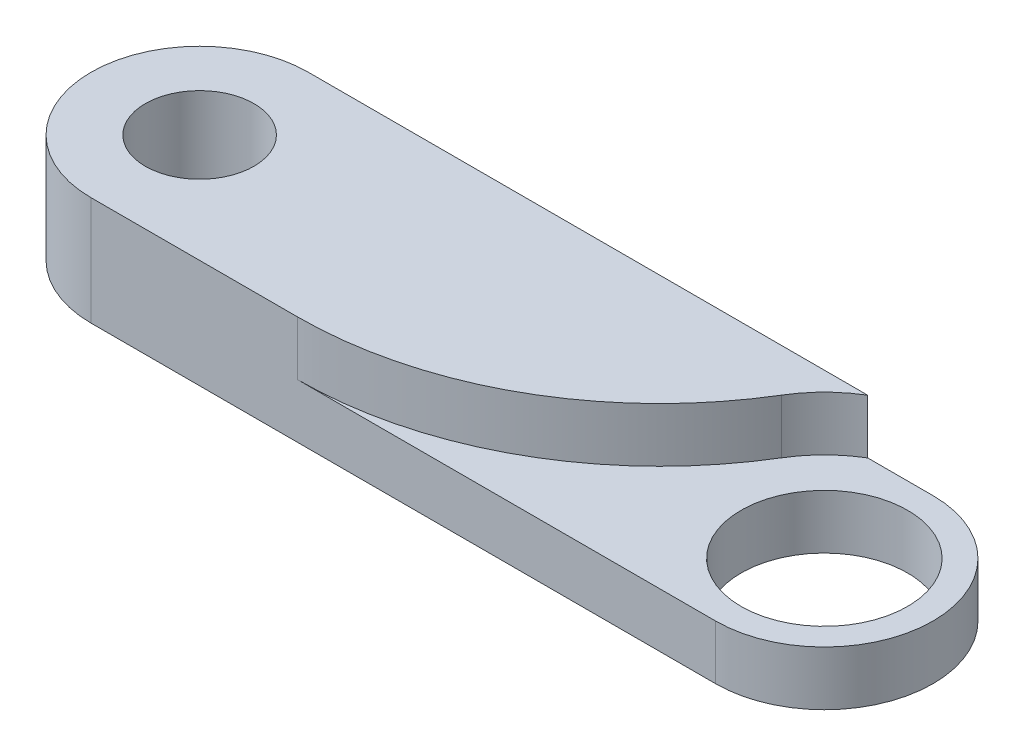
ISO-10303-21;
HEADER;
FILE_DESCRIPTION(('STEP AP214'),'2;1');
FILE_NAME('part.step','',(''),(''),'','','');
FILE_SCHEMA(('AUTOMOTIVE_DESIGN { 1 0 10303 214 1 1 1 1 }'));
ENDSEC;
DATA;
#1=APPLICATION_CONTEXT('core data for automotive mechanical design processes');
#2=APPLICATION_PROTOCOL_DEFINITION('international standard','automotive_design',2000,#1);
#3=PRODUCT_CONTEXT('',#1,'mechanical');
#4=PRODUCT('Part','Part','',(#3));
#5=PRODUCT_RELATED_PRODUCT_CATEGORY('part','',(#4));
#6=PRODUCT_DEFINITION_FORMATION('','',#4);
#7=PRODUCT_DEFINITION_CONTEXT('part definition',#1,'design');
#8=PRODUCT_DEFINITION('design','',#6,#7);
#9=PRODUCT_DEFINITION_SHAPE('','',#8);
#10=(LENGTH_UNIT() NAMED_UNIT(*) SI_UNIT(.MILLI.,.METRE.));
#11=(NAMED_UNIT(*) PLANE_ANGLE_UNIT() SI_UNIT($,.RADIAN.));
#12=(NAMED_UNIT(*) SI_UNIT($,.STERADIAN.) SOLID_ANGLE_UNIT());
#13=UNCERTAINTY_MEASURE_WITH_UNIT(LENGTH_MEASURE(1.E-05),#10,'distance_accuracy_value','');
#14=(GEOMETRIC_REPRESENTATION_CONTEXT(3) GLOBAL_UNCERTAINTY_ASSIGNED_CONTEXT((#13)) GLOBAL_UNIT_ASSIGNED_CONTEXT((#10,
#11,#12)) REPRESENTATION_CONTEXT('',''));
#15=CARTESIAN_POINT('',(0.,0.,0.));
#16=DIRECTION('',(0.,0.,1.));
#17=DIRECTION('',(1.,0.,0.));
#18=AXIS2_PLACEMENT_3D('',#15,#16,#17);
#19=CARTESIAN_POINT('',(17.25,6.,0.));
#20=DIRECTION('',(0.,-1.,0.));
#21=DIRECTION('',(0.,0.,-1.));
#22=AXIS2_PLACEMENT_3D('',#19,#20,#21);
#23=CYLINDRICAL_SURFACE('',#22,6.00000000000001);
#24=CARTESIAN_POINT('',(17.25,3.,0.));
#25=DIRECTION('',(0.,1.,0.));
#26=DIRECTION('',(0.,0.,1.));
#27=AXIS2_PLACEMENT_3D('',#24,#25,#26);
#28=CIRCLE('',#27,6.00000000000001);
#29=CARTESIAN_POINT('',(17.25,3.,6.));
#30=VERTEX_POINT('',#29);
#31=CARTESIAN_POINT('',(17.25,3.,-6.00000000000001));
#32=VERTEX_POINT('',#31);
#33=EDGE_CURVE('E162',#30,#32,#28,.T.);
#34=ORIENTED_EDGE('',*,*,#33,.F.);
#35=DIRECTION('',(0.,-1.,0.));
#36=VECTOR('',#35,1.);
#37=CARTESIAN_POINT('',(17.25,6.,6.));
#38=LINE('',#37,#36);
#39=CARTESIAN_POINT('',(17.25,0.,6.));
#40=VERTEX_POINT('',#39);
#41=EDGE_CURVE('E133',#30,#40,#38,.T.);
#42=ORIENTED_EDGE('',*,*,#41,.T.);
#43=CARTESIAN_POINT('',(17.25,0.,0.));
#44=DIRECTION('',(0.,1.,0.));
#45=DIRECTION('',(0.,0.,1.));
#46=AXIS2_PLACEMENT_3D('',#43,#44,#45);
#47=CIRCLE('',#46,6.00000000000001);
#48=CARTESIAN_POINT('',(17.25,0.,-6.00000000000001));
#49=VERTEX_POINT('',#48);
#50=EDGE_CURVE('E127',#40,#49,#47,.T.);
#51=ORIENTED_EDGE('',*,*,#50,.T.);
#52=DIRECTION('',(0.,-1.,0.));
#53=VECTOR('',#52,1.);
#54=CARTESIAN_POINT('',(17.25,6.,-6.00000000000001));
#55=LINE('',#54,#53);
#56=EDGE_CURVE('E114',#32,#49,#55,.T.);
#57=ORIENTED_EDGE('',*,*,#56,.F.);
#58=EDGE_LOOP('',(#34,#42,#51,#57));
#59=FACE_BOUND('',#58,.T.);
#60=ADVANCED_FACE('F34',(#59),#23,.T.);
#61=CARTESIAN_POINT('',(17.25,6.,0.));
#62=DIRECTION('',(0.,-1.,0.));
#63=DIRECTION('',(0.,0.,-1.));
#64=AXIS2_PLACEMENT_3D('',#61,#62,#63);
#65=CYLINDRICAL_SURFACE('',#64,4.6);
#66=CARTESIAN_POINT('',(17.25,0.,0.));
#67=DIRECTION('',(0.,1.,0.));
#68=DIRECTION('',(0.,0.,1.));
#69=AXIS2_PLACEMENT_3D('',#66,#67,#68);
#70=CIRCLE('',#69,4.6);
#71=CARTESIAN_POINT('',(17.25,0.,4.59999999999999));
#72=VERTEX_POINT('',#71);
#73=EDGE_CURVE('E165',#72,#72,#70,.T.);
#74=ORIENTED_EDGE('',*,*,#73,.F.);
#75=EDGE_LOOP('',(#74));
#76=FACE_BOUND('',#75,.T.);
#77=CARTESIAN_POINT('',(17.25,3.,0.));
#78=DIRECTION('',(0.,1.,0.));
#79=DIRECTION('',(0.,0.,1.));
#80=AXIS2_PLACEMENT_3D('',#77,#78,#79);
#81=CIRCLE('',#80,4.6);
#82=CARTESIAN_POINT('',(17.25,3.,4.59999999999999));
#83=VERTEX_POINT('',#82);
#84=EDGE_CURVE('E137',#83,#83,#81,.T.);
#85=ORIENTED_EDGE('',*,*,#84,.T.);
#86=EDGE_LOOP('',(#85));
#87=FACE_BOUND('',#86,.T.);
#88=ADVANCED_FACE('F192',(#76,#87),#65,.F.);
#89=CARTESIAN_POINT('',(-17.25,6.,0.));
#90=DIRECTION('',(0.,1.,0.));
#91=DIRECTION('',(0.,0.,1.));
#92=AXIS2_PLACEMENT_3D('',#89,#90,#91);
#93=PLANE('',#92);
#94=DIRECTION('',(1.,0.,0.));
#95=VECTOR('',#94,1.);
#96=CARTESIAN_POINT('',(-17.25,6.,6.00000000000001));
#97=LINE('',#96,#95);
#98=CARTESIAN_POINT('',(-17.25,6.,6.00000000000001));
#99=VERTEX_POINT('',#98);
#100=CARTESIAN_POINT('',(-5.8367927612304,6.,6.00000000000001));
#101=VERTEX_POINT('',#100);
#102=EDGE_CURVE('E112',#99,#101,#97,.T.);
#103=ORIENTED_EDGE('',*,*,#102,.T.);
#104=CARTESIAN_POINT('',(-5.8367927612304,6.,-14.));
#105=DIRECTION('',(0.,1.,0.));
#106=DIRECTION('',(0.,0.,1.));
#107=AXIS2_PLACEMENT_3D('',#104,#105,#106);
#108=CIRCLE('',#107,20.);
#109=CARTESIAN_POINT('',(11.2645352100514,6.,-3.62962962962963));
#110=VERTEX_POINT('',#109);
#111=EDGE_CURVE('E56',#101,#110,#108,.T.);
#112=ORIENTED_EDGE('',*,*,#111,.T.);
#113=CARTESIAN_POINT('',(17.25,6.,0.));
#114=DIRECTION('',(0.,1.,0.));
#115=DIRECTION('',(0.,0.,1.));
#116=AXIS2_PLACEMENT_3D('',#113,#114,#115);
#117=CIRCLE('',#116,7.);
#118=CARTESIAN_POINT('',(13.644448724536,6.,-6.00000000000001));
#119=VERTEX_POINT('',#118);
#120=EDGE_CURVE('E94',#119,#110,#117,.T.);
#121=ORIENTED_EDGE('',*,*,#120,.F.);
#122=DIRECTION('',(-1.,0.,0.));
#123=VECTOR('',#122,1.);
#124=CARTESIAN_POINT('',(-17.25,6.,-6.00000000000001));
#125=LINE('',#124,#123);
#126=CARTESIAN_POINT('',(-17.25,6.,-6.00000000000001));
#127=VERTEX_POINT('',#126);
#128=EDGE_CURVE('E105',#119,#127,#125,.T.);
#129=ORIENTED_EDGE('',*,*,#128,.T.);
#130=CARTESIAN_POINT('',(-17.25,6.,0.));
#131=DIRECTION('',(0.,1.,0.));
#132=DIRECTION('',(0.,0.,1.));
#133=AXIS2_PLACEMENT_3D('',#130,#131,#132);
#134=CIRCLE('',#133,6.00000000000001);
#135=EDGE_CURVE('E116',#127,#99,#134,.T.);
#136=ORIENTED_EDGE('',*,*,#135,.T.);
#137=EDGE_LOOP('',(#103,#112,#121,#129,#136));
#138=FACE_BOUND('',#137,.T.);
#139=CARTESIAN_POINT('',(-17.25,6.,0.));
#140=DIRECTION('',(0.,1.,0.));
#141=DIRECTION('',(0.,0.,1.));
#142=AXIS2_PLACEMENT_3D('',#139,#140,#141);
#143=CIRCLE('',#142,3.);
#144=CARTESIAN_POINT('',(-17.25,6.,3.));
#145=VERTEX_POINT('',#144);
#146=EDGE_CURVE('E124',#145,#145,#143,.T.);
#147=ORIENTED_EDGE('',*,*,#146,.F.);
#148=EDGE_LOOP('',(#147));
#149=FACE_BOUND('',#148,.T.);
#150=ADVANCED_FACE('F102',(#138,#149),#93,.T.);
#151=CARTESIAN_POINT('',(-17.25,0.,0.));
#152=DIRECTION('',(0.,1.,0.));
#153=DIRECTION('',(0.,0.,1.));
#154=AXIS2_PLACEMENT_3D('',#151,#152,#153);
#155=PLANE('',#154);
#156=CARTESIAN_POINT('',(-17.25,0.,0.));
#157=DIRECTION('',(0.,1.,0.));
#158=DIRECTION('',(0.,0.,1.));
#159=AXIS2_PLACEMENT_3D('',#156,#157,#158);
#160=CIRCLE('',#159,6.00000000000001);
#161=CARTESIAN_POINT('',(-17.25,0.,-6.00000000000001));
#162=VERTEX_POINT('',#161);
#163=CARTESIAN_POINT('',(-17.25,0.,6.00000000000001));
#164=VERTEX_POINT('',#163);
#165=EDGE_CURVE('E120',#162,#164,#160,.T.);
#166=ORIENTED_EDGE('',*,*,#165,.F.);
#167=DIRECTION('',(-1.,0.,0.));
#168=VECTOR('',#167,1.);
#169=CARTESIAN_POINT('',(-17.25,0.,-6.00000000000001));
#170=LINE('',#169,#168);
#171=EDGE_CURVE('E130',#49,#162,#170,.T.);
#172=ORIENTED_EDGE('',*,*,#171,.F.);
#173=ORIENTED_EDGE('',*,*,#50,.F.);
#174=DIRECTION('',(1.,0.,0.));
#175=VECTOR('',#174,1.);
#176=CARTESIAN_POINT('',(-17.25,0.,6.00000000000001));
#177=LINE('',#176,#175);
#178=EDGE_CURVE('E123',#164,#40,#177,.T.);
#179=ORIENTED_EDGE('',*,*,#178,.F.);
#180=EDGE_LOOP('',(#166,#172,#173,#179));
#181=FACE_BOUND('',#180,.T.);
#182=CARTESIAN_POINT('',(-17.25,0.,0.));
#183=DIRECTION('',(0.,1.,0.));
#184=DIRECTION('',(0.,0.,1.));
#185=AXIS2_PLACEMENT_3D('',#182,#183,#184);
#186=CIRCLE('',#185,3.);
#187=CARTESIAN_POINT('',(-17.25,0.,3.));
#188=VERTEX_POINT('',#187);
#189=EDGE_CURVE('E171',#188,#188,#186,.T.);
#190=ORIENTED_EDGE('',*,*,#189,.T.);
#191=EDGE_LOOP('',(#190));
#192=FACE_BOUND('',#191,.T.);
#193=ORIENTED_EDGE('',*,*,#73,.T.);
#194=EDGE_LOOP('',(#193));
#195=FACE_BOUND('',#194,.T.);
#196=ADVANCED_FACE('F157',(#181,#192,#195),#155,.F.);
#197=CARTESIAN_POINT('',(-17.25,6.,0.));
#198=DIRECTION('',(0.,-1.,0.));
#199=DIRECTION('',(0.,0.,-1.));
#200=AXIS2_PLACEMENT_3D('',#197,#198,#199);
#201=CYLINDRICAL_SURFACE('',#200,6.00000000000001);
#202=ORIENTED_EDGE('',*,*,#165,.T.);
#203=DIRECTION('',(0.,-1.,0.));
#204=VECTOR('',#203,1.);
#205=CARTESIAN_POINT('',(-17.25,6.,6.00000000000001));
#206=LINE('',#205,#204);
#207=EDGE_CURVE('E100',#99,#164,#206,.T.);
#208=ORIENTED_EDGE('',*,*,#207,.F.);
#209=ORIENTED_EDGE('',*,*,#135,.F.);
#210=DIRECTION('',(0.,-1.,0.));
#211=VECTOR('',#210,1.);
#212=CARTESIAN_POINT('',(-17.25,6.,-6.00000000000001));
#213=LINE('',#212,#211);
#214=EDGE_CURVE('E110',#127,#162,#213,.T.);
#215=ORIENTED_EDGE('',*,*,#214,.T.);
#216=EDGE_LOOP('',(#202,#208,#209,#215));
#217=FACE_BOUND('',#216,.T.);
#218=ADVANCED_FACE('F152',(#217),#201,.T.);
#219=CARTESIAN_POINT('',(-17.25,6.,6.00000000000001));
#220=DIRECTION('',(0.,0.,-1.));
#221=DIRECTION('',(-1.,0.,0.));
#222=AXIS2_PLACEMENT_3D('',#219,#220,#221);
#223=PLANE('',#222);
#224=DIRECTION('',(1.,0.,0.));
#225=VECTOR('',#224,1.);
#226=CARTESIAN_POINT('',(-17.25,3.,6.00000000000001));
#227=LINE('',#226,#225);
#228=CARTESIAN_POINT('',(-5.8367927612304,3.,6.00000000000001));
#229=VERTEX_POINT('',#228);
#230=EDGE_CURVE('E147',#229,#30,#227,.T.);
#231=ORIENTED_EDGE('',*,*,#230,.F.);
#232=DIRECTION('',(0.,1.,0.));
#233=VECTOR('',#232,1.);
#234=CARTESIAN_POINT('',(-5.8367927612304,6.,6.00000000000001));
#235=LINE('',#234,#233);
#236=EDGE_CURVE('E99',#229,#101,#235,.T.);
#237=ORIENTED_EDGE('',*,*,#236,.T.);
#238=ORIENTED_EDGE('',*,*,#102,.F.);
#239=ORIENTED_EDGE('',*,*,#207,.T.);
#240=ORIENTED_EDGE('',*,*,#178,.T.);
#241=ORIENTED_EDGE('',*,*,#41,.F.);
#242=EDGE_LOOP('',(#231,#237,#238,#239,#240,#241));
#243=FACE_BOUND('',#242,.T.);
#244=ADVANCED_FACE('F145',(#243),#223,.F.);
#245=CARTESIAN_POINT('',(-17.25,6.,-6.00000000000001));
#246=DIRECTION('',(0.,0.,1.));
#247=DIRECTION('',(1.,0.,0.));
#248=AXIS2_PLACEMENT_3D('',#245,#246,#247);
#249=PLANE('',#248);
#250=ORIENTED_EDGE('',*,*,#128,.F.);
#251=DIRECTION('',(0.,1.,0.));
#252=VECTOR('',#251,1.);
#253=CARTESIAN_POINT('',(13.644448724536,3.,-6.00000000000001));
#254=LINE('',#253,#252);
#255=CARTESIAN_POINT('',(13.644448724536,3.,-6.00000000000001));
#256=VERTEX_POINT('',#255);
#257=EDGE_CURVE('E92',#119,#256,#254,.F.);
#258=ORIENTED_EDGE('',*,*,#257,.T.);
#259=DIRECTION('',(-1.,0.,0.));
#260=VECTOR('',#259,1.);
#261=CARTESIAN_POINT('',(-17.25,3.,-6.00000000000001));
#262=LINE('',#261,#260);
#263=EDGE_CURVE('E139',#32,#256,#262,.T.);
#264=ORIENTED_EDGE('',*,*,#263,.F.);
#265=ORIENTED_EDGE('',*,*,#56,.T.);
#266=ORIENTED_EDGE('',*,*,#171,.T.);
#267=ORIENTED_EDGE('',*,*,#214,.F.);
#268=EDGE_LOOP('',(#250,#258,#264,#265,#266,#267));
#269=FACE_BOUND('',#268,.T.);
#270=ADVANCED_FACE('F108',(#269),#249,.F.);
#271=CARTESIAN_POINT('',(-17.25,6.,0.));
#272=DIRECTION('',(0.,-1.,0.));
#273=DIRECTION('',(0.,0.,-1.));
#274=AXIS2_PLACEMENT_3D('',#271,#272,#273);
#275=CYLINDRICAL_SURFACE('',#274,3.);
#276=ORIENTED_EDGE('',*,*,#146,.T.);
#277=EDGE_LOOP('',(#276));
#278=FACE_BOUND('',#277,.T.);
#279=ORIENTED_EDGE('',*,*,#189,.F.);
#280=EDGE_LOOP('',(#279));
#281=FACE_BOUND('',#280,.T.);
#282=ADVANCED_FACE('F178',(#278,#281),#275,.F.);
#283=CARTESIAN_POINT('',(17.25,3.,0.));
#284=DIRECTION('',(0.,1.,0.));
#285=DIRECTION('',(0.,0.,1.));
#286=AXIS2_PLACEMENT_3D('',#283,#284,#285);
#287=CYLINDRICAL_SURFACE('',#286,7.);
#288=ORIENTED_EDGE('',*,*,#120,.T.);
#289=DIRECTION('',(0.,1.,0.));
#290=VECTOR('',#289,1.);
#291=CARTESIAN_POINT('',(11.2645352100514,3.,-3.62962962962963));
#292=LINE('',#291,#290);
#293=CARTESIAN_POINT('',(11.2645352100514,3.,-3.62962962962963));
#294=VERTEX_POINT('',#293);
#295=EDGE_CURVE('E42',#110,#294,#292,.F.);
#296=ORIENTED_EDGE('',*,*,#295,.T.);
#297=CARTESIAN_POINT('',(17.25,3.,0.));
#298=DIRECTION('',(0.,1.,0.));
#299=DIRECTION('',(0.,0.,1.));
#300=AXIS2_PLACEMENT_3D('',#297,#298,#299);
#301=CIRCLE('',#300,7.);
#302=EDGE_CURVE('E95',#256,#294,#301,.T.);
#303=ORIENTED_EDGE('',*,*,#302,.F.);
#304=ORIENTED_EDGE('',*,*,#257,.F.);
#305=EDGE_LOOP('',(#288,#296,#303,#304));
#306=FACE_BOUND('',#305,.T.);
#307=ADVANCED_FACE('F93',(#306),#287,.F.);
#308=CARTESIAN_POINT('',(17.25,3.,0.));
#309=DIRECTION('',(0.,1.,0.));
#310=DIRECTION('',(0.,0.,1.));
#311=AXIS2_PLACEMENT_3D('',#308,#309,#310);
#312=PLANE('',#311);
#313=ORIENTED_EDGE('',*,*,#84,.F.);
#314=EDGE_LOOP('',(#313));
#315=FACE_BOUND('',#314,.T.);
#316=ORIENTED_EDGE('',*,*,#230,.T.);
#317=ORIENTED_EDGE('',*,*,#33,.T.);
#318=ORIENTED_EDGE('',*,*,#263,.T.);
#319=ORIENTED_EDGE('',*,*,#302,.T.);
#320=CARTESIAN_POINT('',(-5.8367927612304,3.,-14.));
#321=DIRECTION('',(0.,1.,0.));
#322=DIRECTION('',(0.,0.,1.));
#323=AXIS2_PLACEMENT_3D('',#320,#321,#322);
#324=CIRCLE('',#323,20.);
#325=EDGE_CURVE('E11',#294,#229,#324,.F.);
#326=ORIENTED_EDGE('',*,*,#325,.T.);
#327=EDGE_LOOP('',(#316,#317,#318,#319,#326));
#328=FACE_BOUND('',#327,.T.);
#329=ADVANCED_FACE('F186',(#315,#328),#312,.T.);
#330=CARTESIAN_POINT('',(-5.8367927612304,3.,-14.));
#331=DIRECTION('',(0.,1.,0.));
#332=DIRECTION('',(0.,0.,1.));
#333=AXIS2_PLACEMENT_3D('',#330,#331,#332);
#334=CYLINDRICAL_SURFACE('',#333,20.);
#335=ORIENTED_EDGE('',*,*,#325,.F.);
#336=ORIENTED_EDGE('',*,*,#295,.F.);
#337=ORIENTED_EDGE('',*,*,#111,.F.);
#338=ORIENTED_EDGE('',*,*,#236,.F.);
#339=EDGE_LOOP('',(#335,#336,#337,#338));
#340=FACE_BOUND('',#339,.T.);
#341=ADVANCED_FACE('F36',(#340),#334,.T.);
#342=CLOSED_SHELL('',(#60,#88,#150,#196,#218,#244,#270,#282,#307,#329,#341));
#343=MANIFOLD_SOLID_BREP('B2',#342);
#344=ADVANCED_BREP_SHAPE_REPRESENTATION('',(#18,#343),#14);
#345=SHAPE_DEFINITION_REPRESENTATION(#9,#344);
ENDSEC;
END-ISO-10303-21;
